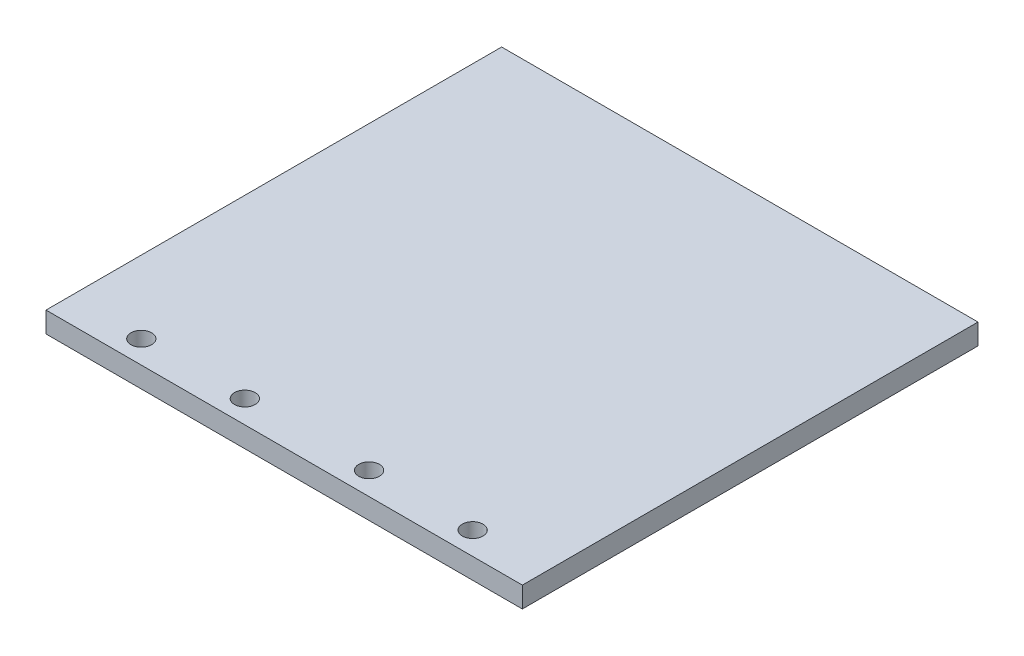
ISO-10303-21;
HEADER;
FILE_DESCRIPTION(('STEP AP214'),'2;1');
FILE_NAME('part.step','',(''),(''),'','','');
FILE_SCHEMA(('AUTOMOTIVE_DESIGN { 1 0 10303 214 1 1 1 1 }'));
ENDSEC;
DATA;
#1=APPLICATION_CONTEXT('core data for automotive mechanical design processes');
#2=APPLICATION_PROTOCOL_DEFINITION('international standard','automotive_design',2000,#1);
#3=PRODUCT_CONTEXT('',#1,'mechanical');
#4=PRODUCT('Part','Part','',(#3));
#5=PRODUCT_RELATED_PRODUCT_CATEGORY('part','',(#4));
#6=PRODUCT_DEFINITION_FORMATION('','',#4);
#7=PRODUCT_DEFINITION_CONTEXT('part definition',#1,'design');
#8=PRODUCT_DEFINITION('design','',#6,#7);
#9=PRODUCT_DEFINITION_SHAPE('','',#8);
#10=(LENGTH_UNIT() NAMED_UNIT(*) SI_UNIT(.MILLI.,.METRE.));
#11=(NAMED_UNIT(*) PLANE_ANGLE_UNIT() SI_UNIT($,.RADIAN.));
#12=(NAMED_UNIT(*) SI_UNIT($,.STERADIAN.) SOLID_ANGLE_UNIT());
#13=UNCERTAINTY_MEASURE_WITH_UNIT(LENGTH_MEASURE(1.E-05),#10,'distance_accuracy_value','');
#14=(GEOMETRIC_REPRESENTATION_CONTEXT(3) GLOBAL_UNCERTAINTY_ASSIGNED_CONTEXT((#13)) GLOBAL_UNIT_ASSIGNED_CONTEXT((#10,
#11,#12)) REPRESENTATION_CONTEXT('',''));
#15=CARTESIAN_POINT('',(0.,0.,0.));
#16=DIRECTION('',(0.,0.,1.));
#17=DIRECTION('',(1.,0.,0.));
#18=AXIS2_PLACEMENT_3D('',#15,#16,#17);
#19=CARTESIAN_POINT('',(-57.5,5.,-55.));
#20=DIRECTION('',(1.,0.,0.));
#21=DIRECTION('',(0.,0.,-1.));
#22=AXIS2_PLACEMENT_3D('',#19,#20,#21);
#23=PLANE('',#22);
#24=DIRECTION('',(0.,0.,1.));
#25=VECTOR('',#24,1.);
#26=CARTESIAN_POINT('',(-57.5,0.,-55.));
#27=LINE('',#26,#25);
#28=CARTESIAN_POINT('',(-57.5,0.,-55.));
#29=VERTEX_POINT('',#28);
#30=CARTESIAN_POINT('',(-57.5,0.,55.));
#31=VERTEX_POINT('',#30);
#32=EDGE_CURVE('E103',#29,#31,#27,.T.);
#33=ORIENTED_EDGE('',*,*,#32,.T.);
#34=DIRECTION('',(0.,-1.,0.));
#35=VECTOR('',#34,1.);
#36=CARTESIAN_POINT('',(-57.5,5.,55.));
#37=LINE('',#36,#35);
#38=CARTESIAN_POINT('',(-57.5,5.,55.));
#39=VERTEX_POINT('',#38);
#40=EDGE_CURVE('E11',#39,#31,#37,.T.);
#41=ORIENTED_EDGE('',*,*,#40,.F.);
#42=DIRECTION('',(0.,0.,1.));
#43=VECTOR('',#42,1.);
#44=CARTESIAN_POINT('',(-57.5,5.,-55.));
#45=LINE('',#44,#43);
#46=CARTESIAN_POINT('',(-57.5,5.,-55.));
#47=VERTEX_POINT('',#46);
#48=EDGE_CURVE('E91',#47,#39,#45,.T.);
#49=ORIENTED_EDGE('',*,*,#48,.F.);
#50=DIRECTION('',(0.,-1.,0.));
#51=VECTOR('',#50,1.);
#52=CARTESIAN_POINT('',(-57.5,5.,-55.));
#53=LINE('',#52,#51);
#54=EDGE_CURVE('E99',#47,#29,#53,.T.);
#55=ORIENTED_EDGE('',*,*,#54,.T.);
#56=EDGE_LOOP('',(#33,#41,#49,#55));
#57=FACE_BOUND('',#56,.T.);
#58=ADVANCED_FACE('F40',(#57),#23,.F.);
#59=CARTESIAN_POINT('',(-57.5,5.,55.));
#60=DIRECTION('',(0.,0.,-1.));
#61=DIRECTION('',(-1.,0.,0.));
#62=AXIS2_PLACEMENT_3D('',#59,#60,#61);
#63=PLANE('',#62);
#64=DIRECTION('',(1.,0.,0.));
#65=VECTOR('',#64,1.);
#66=CARTESIAN_POINT('',(-57.5,0.,55.));
#67=LINE('',#66,#65);
#68=CARTESIAN_POINT('',(57.5,0.,55.));
#69=VERTEX_POINT('',#68);
#70=EDGE_CURVE('E95',#31,#69,#67,.T.);
#71=ORIENTED_EDGE('',*,*,#70,.T.);
#72=DIRECTION('',(0.,-1.,0.));
#73=VECTOR('',#72,1.);
#74=CARTESIAN_POINT('',(57.5,5.,55.));
#75=LINE('',#74,#73);
#76=CARTESIAN_POINT('',(57.5,5.,55.));
#77=VERTEX_POINT('',#76);
#78=EDGE_CURVE('E48',#77,#69,#75,.T.);
#79=ORIENTED_EDGE('',*,*,#78,.F.);
#80=DIRECTION('',(1.,0.,0.));
#81=VECTOR('',#80,1.);
#82=CARTESIAN_POINT('',(-57.5,5.,55.));
#83=LINE('',#82,#81);
#84=EDGE_CURVE('E86',#39,#77,#83,.T.);
#85=ORIENTED_EDGE('',*,*,#84,.F.);
#86=ORIENTED_EDGE('',*,*,#40,.T.);
#87=EDGE_LOOP('',(#71,#79,#85,#86));
#88=FACE_BOUND('',#87,.T.);
#89=ADVANCED_FACE('F94',(#88),#63,.F.);
#90=CARTESIAN_POINT('',(57.5,5.,-55.));
#91=DIRECTION('',(-1.,0.,0.));
#92=DIRECTION('',(0.,0.,1.));
#93=AXIS2_PLACEMENT_3D('',#90,#91,#92);
#94=PLANE('',#93);
#95=DIRECTION('',(0.,0.,-1.));
#96=VECTOR('',#95,1.);
#97=CARTESIAN_POINT('',(57.5,0.,-55.));
#98=LINE('',#97,#96);
#99=CARTESIAN_POINT('',(57.5,0.,-55.));
#100=VERTEX_POINT('',#99);
#101=EDGE_CURVE('E73',#69,#100,#98,.T.);
#102=ORIENTED_EDGE('',*,*,#101,.T.);
#103=DIRECTION('',(0.,-1.,0.));
#104=VECTOR('',#103,1.);
#105=CARTESIAN_POINT('',(57.5,5.,-55.));
#106=LINE('',#105,#104);
#107=CARTESIAN_POINT('',(57.5,5.,-55.));
#108=VERTEX_POINT('',#107);
#109=EDGE_CURVE('E96',#108,#100,#106,.T.);
#110=ORIENTED_EDGE('',*,*,#109,.F.);
#111=DIRECTION('',(0.,0.,-1.));
#112=VECTOR('',#111,1.);
#113=CARTESIAN_POINT('',(57.5,5.,-55.));
#114=LINE('',#113,#112);
#115=EDGE_CURVE('E89',#77,#108,#114,.T.);
#116=ORIENTED_EDGE('',*,*,#115,.F.);
#117=ORIENTED_EDGE('',*,*,#78,.T.);
#118=EDGE_LOOP('',(#102,#110,#116,#117));
#119=FACE_BOUND('',#118,.T.);
#120=ADVANCED_FACE('F97',(#119),#94,.F.);
#121=CARTESIAN_POINT('',(-57.5,5.,-55.));
#122=DIRECTION('',(0.,0.,1.));
#123=DIRECTION('',(1.,0.,0.));
#124=AXIS2_PLACEMENT_3D('',#121,#122,#123);
#125=PLANE('',#124);
#126=DIRECTION('',(-1.,0.,0.));
#127=VECTOR('',#126,1.);
#128=CARTESIAN_POINT('',(-57.5,0.,-55.));
#129=LINE('',#128,#127);
#130=EDGE_CURVE('E79',#100,#29,#129,.T.);
#131=ORIENTED_EDGE('',*,*,#130,.T.);
#132=ORIENTED_EDGE('',*,*,#54,.F.);
#133=DIRECTION('',(-1.,0.,0.));
#134=VECTOR('',#133,1.);
#135=CARTESIAN_POINT('',(-57.5,5.,-55.));
#136=LINE('',#135,#134);
#137=EDGE_CURVE('E56',#108,#47,#136,.T.);
#138=ORIENTED_EDGE('',*,*,#137,.F.);
#139=ORIENTED_EDGE('',*,*,#109,.T.);
#140=EDGE_LOOP('',(#131,#132,#138,#139));
#141=FACE_BOUND('',#140,.T.);
#142=ADVANCED_FACE('F111',(#141),#125,.F.);
#143=CARTESIAN_POINT('',(0.,5.,0.));
#144=DIRECTION('',(0.,1.,0.));
#145=DIRECTION('',(0.,0.,1.));
#146=AXIS2_PLACEMENT_3D('',#143,#144,#145);
#147=PLANE('',#146);
#148=CARTESIAN_POINT('',(-40.,5.,49.5));
#149=DIRECTION('',(0.,1.,0.));
#150=DIRECTION('',(0.,0.,1.));
#151=AXIS2_PLACEMENT_3D('',#148,#149,#150);
#152=CIRCLE('',#151,2.5);
#153=CARTESIAN_POINT('',(-40.,5.,52.));
#154=VERTEX_POINT('',#153);
#155=EDGE_CURVE('E130',#154,#154,#152,.F.);
#156=ORIENTED_EDGE('',*,*,#155,.T.);
#157=EDGE_LOOP('',(#156));
#158=FACE_BOUND('',#157,.T.);
#159=CARTESIAN_POINT('',(15.,5.,49.5));
#160=DIRECTION('',(0.,1.,0.));
#161=DIRECTION('',(0.,0.,1.));
#162=AXIS2_PLACEMENT_3D('',#159,#160,#161);
#163=CIRCLE('',#162,2.5);
#164=CARTESIAN_POINT('',(15.,5.,52.));
#165=VERTEX_POINT('',#164);
#166=EDGE_CURVE('E131',#165,#165,#163,.F.);
#167=ORIENTED_EDGE('',*,*,#166,.T.);
#168=EDGE_LOOP('',(#167));
#169=FACE_BOUND('',#168,.T.);
#170=CARTESIAN_POINT('',(40.,5.,49.5));
#171=DIRECTION('',(0.,1.,0.));
#172=DIRECTION('',(0.,0.,1.));
#173=AXIS2_PLACEMENT_3D('',#170,#171,#172);
#174=CIRCLE('',#173,2.5);
#175=CARTESIAN_POINT('',(40.,5.,52.));
#176=VERTEX_POINT('',#175);
#177=EDGE_CURVE('E117',#176,#176,#174,.F.);
#178=ORIENTED_EDGE('',*,*,#177,.T.);
#179=EDGE_LOOP('',(#178));
#180=FACE_BOUND('',#179,.T.);
#181=CARTESIAN_POINT('',(-15.,5.,49.5));
#182=DIRECTION('',(0.,1.,0.));
#183=DIRECTION('',(0.,0.,1.));
#184=AXIS2_PLACEMENT_3D('',#181,#182,#183);
#185=CIRCLE('',#184,2.5);
#186=CARTESIAN_POINT('',(-15.,5.,52.));
#187=VERTEX_POINT('',#186);
#188=EDGE_CURVE('E124',#187,#187,#185,.F.);
#189=ORIENTED_EDGE('',*,*,#188,.T.);
#190=EDGE_LOOP('',(#189));
#191=FACE_BOUND('',#190,.T.);
#192=ORIENTED_EDGE('',*,*,#48,.T.);
#193=ORIENTED_EDGE('',*,*,#84,.T.);
#194=ORIENTED_EDGE('',*,*,#115,.T.);
#195=ORIENTED_EDGE('',*,*,#137,.T.);
#196=EDGE_LOOP('',(#192,#193,#194,#195));
#197=FACE_BOUND('',#196,.T.);
#198=ADVANCED_FACE('F87',(#158,#169,#180,#191,#197),#147,.T.);
#199=CARTESIAN_POINT('',(0.,0.,0.));
#200=DIRECTION('',(0.,1.,0.));
#201=DIRECTION('',(0.,0.,1.));
#202=AXIS2_PLACEMENT_3D('',#199,#200,#201);
#203=PLANE('',#202);
#204=CARTESIAN_POINT('',(-40.,0.,49.5));
#205=DIRECTION('',(0.,-1.,0.));
#206=DIRECTION('',(0.,0.,-1.));
#207=AXIS2_PLACEMENT_3D('',#204,#205,#206);
#208=CIRCLE('',#207,2.5);
#209=CARTESIAN_POINT('',(-40.,0.,47.));
#210=VERTEX_POINT('',#209);
#211=EDGE_CURVE('E106',#210,#210,#208,.T.);
#212=ORIENTED_EDGE('',*,*,#211,.F.);
#213=EDGE_LOOP('',(#212));
#214=FACE_BOUND('',#213,.T.);
#215=CARTESIAN_POINT('',(15.,0.,49.5));
#216=DIRECTION('',(0.,-1.,0.));
#217=DIRECTION('',(0.,0.,1.));
#218=AXIS2_PLACEMENT_3D('',#215,#216,#217);
#219=CIRCLE('',#218,2.5);
#220=CARTESIAN_POINT('',(15.,0.,52.));
#221=VERTEX_POINT('',#220);
#222=EDGE_CURVE('E121',#221,#221,#219,.T.);
#223=ORIENTED_EDGE('',*,*,#222,.F.);
#224=EDGE_LOOP('',(#223));
#225=FACE_BOUND('',#224,.T.);
#226=CARTESIAN_POINT('',(40.,0.,49.5));
#227=DIRECTION('',(0.,-1.,0.));
#228=DIRECTION('',(0.,0.,1.));
#229=AXIS2_PLACEMENT_3D('',#226,#227,#228);
#230=CIRCLE('',#229,2.5);
#231=CARTESIAN_POINT('',(40.,0.,52.));
#232=VERTEX_POINT('',#231);
#233=EDGE_CURVE('E120',#232,#232,#230,.T.);
#234=ORIENTED_EDGE('',*,*,#233,.F.);
#235=EDGE_LOOP('',(#234));
#236=FACE_BOUND('',#235,.T.);
#237=CARTESIAN_POINT('',(-15.,0.,49.5));
#238=DIRECTION('',(0.,-1.,0.));
#239=DIRECTION('',(0.,0.,-1.));
#240=AXIS2_PLACEMENT_3D('',#237,#238,#239);
#241=CIRCLE('',#240,2.5);
#242=CARTESIAN_POINT('',(-15.,0.,47.));
#243=VERTEX_POINT('',#242);
#244=EDGE_CURVE('E127',#243,#243,#241,.T.);
#245=ORIENTED_EDGE('',*,*,#244,.F.);
#246=EDGE_LOOP('',(#245));
#247=FACE_BOUND('',#246,.T.);
#248=ORIENTED_EDGE('',*,*,#32,.F.);
#249=ORIENTED_EDGE('',*,*,#130,.F.);
#250=ORIENTED_EDGE('',*,*,#101,.F.);
#251=ORIENTED_EDGE('',*,*,#70,.F.);
#252=EDGE_LOOP('',(#248,#249,#250,#251));
#253=FACE_BOUND('',#252,.T.);
#254=ADVANCED_FACE('F114',(#214,#225,#236,#247,#253),#203,.F.);
#255=CARTESIAN_POINT('',(-15.,5.001,49.5));
#256=DIRECTION('',(0.,-1.,0.));
#257=DIRECTION('',(0.,0.,-1.));
#258=AXIS2_PLACEMENT_3D('',#255,#256,#257);
#259=CYLINDRICAL_SURFACE('',#258,2.5);
#260=ORIENTED_EDGE('',*,*,#188,.F.);
#261=EDGE_LOOP('',(#260));
#262=FACE_BOUND('',#261,.T.);
#263=ORIENTED_EDGE('',*,*,#244,.T.);
#264=EDGE_LOOP('',(#263));
#265=FACE_BOUND('',#264,.T.);
#266=ADVANCED_FACE('F145',(#262,#265),#259,.F.);
#267=CARTESIAN_POINT('',(40.,5.001,49.5));
#268=DIRECTION('',(0.,-1.,0.));
#269=DIRECTION('',(0.,0.,-1.));
#270=AXIS2_PLACEMENT_3D('',#267,#268,#269);
#271=CYLINDRICAL_SURFACE('',#270,2.5);
#272=ORIENTED_EDGE('',*,*,#177,.F.);
#273=EDGE_LOOP('',(#272));
#274=FACE_BOUND('',#273,.T.);
#275=ORIENTED_EDGE('',*,*,#233,.T.);
#276=EDGE_LOOP('',(#275));
#277=FACE_BOUND('',#276,.T.);
#278=ADVANCED_FACE('F154',(#274,#277),#271,.F.);
#279=CARTESIAN_POINT('',(15.,5.001,49.5));
#280=DIRECTION('',(0.,-1.,0.));
#281=DIRECTION('',(0.,0.,-1.));
#282=AXIS2_PLACEMENT_3D('',#279,#280,#281);
#283=CYLINDRICAL_SURFACE('',#282,2.5);
#284=ORIENTED_EDGE('',*,*,#166,.F.);
#285=EDGE_LOOP('',(#284));
#286=FACE_BOUND('',#285,.T.);
#287=ORIENTED_EDGE('',*,*,#222,.T.);
#288=EDGE_LOOP('',(#287));
#289=FACE_BOUND('',#288,.T.);
#290=ADVANCED_FACE('F160',(#286,#289),#283,.F.);
#291=CARTESIAN_POINT('',(-40.,5.001,49.5));
#292=DIRECTION('',(0.,-1.,0.));
#293=DIRECTION('',(0.,0.,-1.));
#294=AXIS2_PLACEMENT_3D('',#291,#292,#293);
#295=CYLINDRICAL_SURFACE('',#294,2.5);
#296=ORIENTED_EDGE('',*,*,#155,.F.);
#297=EDGE_LOOP('',(#296));
#298=FACE_BOUND('',#297,.T.);
#299=ORIENTED_EDGE('',*,*,#211,.T.);
#300=EDGE_LOOP('',(#299));
#301=FACE_BOUND('',#300,.T.);
#302=ADVANCED_FACE('F141',(#298,#301),#295,.F.);
#303=CLOSED_SHELL('',(#58,#89,#120,#142,#198,#254,#266,#278,#290,#302));
#304=MANIFOLD_SOLID_BREP('B2',#303);
#305=ADVANCED_BREP_SHAPE_REPRESENTATION('',(#18,#304),#14);
#306=SHAPE_DEFINITION_REPRESENTATION(#9,#305);
ENDSEC;
END-ISO-10303-21;
